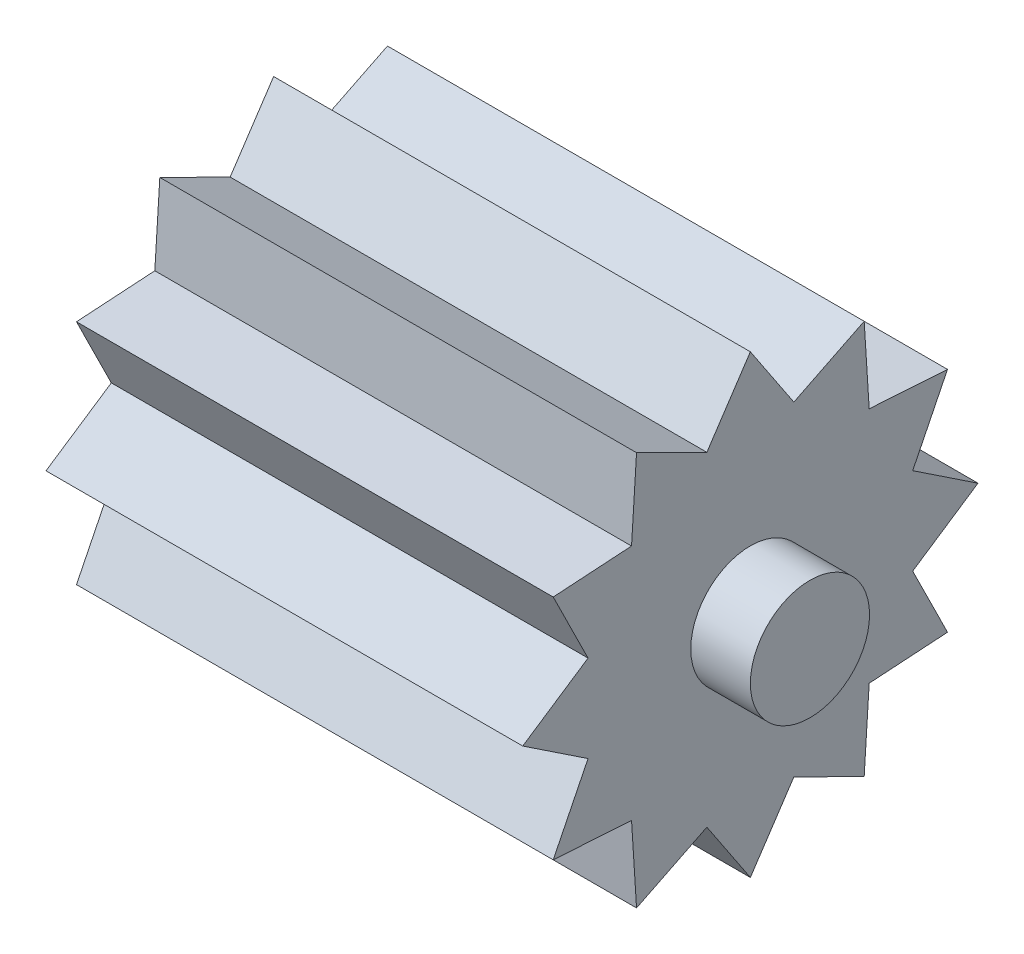
ISO-10303-21;
HEADER;
FILE_DESCRIPTION(('STEP AP214'),'2;1');
FILE_NAME('part.step','',(''),(''),'','','');
FILE_SCHEMA(('AUTOMOTIVE_DESIGN { 1 0 10303 214 1 1 1 1 }'));
ENDSEC;
DATA;
#1=APPLICATION_CONTEXT('core data for automotive mechanical design processes');
#2=APPLICATION_PROTOCOL_DEFINITION('international standard','automotive_design',2000,#1);
#3=PRODUCT_CONTEXT('',#1,'mechanical');
#4=PRODUCT('Part','Part','',(#3));
#5=PRODUCT_RELATED_PRODUCT_CATEGORY('part','',(#4));
#6=PRODUCT_DEFINITION_FORMATION('','',#4);
#7=PRODUCT_DEFINITION_CONTEXT('part definition',#1,'design');
#8=PRODUCT_DEFINITION('design','',#6,#7);
#9=PRODUCT_DEFINITION_SHAPE('','',#8);
#10=(LENGTH_UNIT() NAMED_UNIT(*) SI_UNIT(.MILLI.,.METRE.));
#11=(NAMED_UNIT(*) PLANE_ANGLE_UNIT() SI_UNIT($,.RADIAN.));
#12=(NAMED_UNIT(*) SI_UNIT($,.STERADIAN.) SOLID_ANGLE_UNIT());
#13=UNCERTAINTY_MEASURE_WITH_UNIT(LENGTH_MEASURE(1.E-05),#10,'distance_accuracy_value','');
#14=(GEOMETRIC_REPRESENTATION_CONTEXT(3) GLOBAL_UNCERTAINTY_ASSIGNED_CONTEXT((#13)) GLOBAL_UNIT_ASSIGNED_CONTEXT((#10,
#11,#12)) REPRESENTATION_CONTEXT('',''));
#15=CARTESIAN_POINT('',(0.,0.,0.));
#16=DIRECTION('',(0.,0.,1.));
#17=DIRECTION('',(1.,0.,0.));
#18=AXIS2_PLACEMENT_3D('',#15,#16,#17);
#19=CARTESIAN_POINT('',(-10.,8.27054260614139,-4.77500000000001));
#20=DIRECTION('',(0.,0.0638193116647596,-0.997961469926889));
#21=DIRECTION('',(0.,0.997961469926889,0.0638193116647596));
#22=AXIS2_PLACEMENT_3D('',#19,#20,#21);
#23=PLANE('',#22);
#24=DIRECTION('',(0.,0.997961469926889,0.0638193116647596));
#25=VECTOR('',#24,1.);
#26=CARTESIAN_POINT('',(0.,8.27054260614139,-4.77500000000001));
#27=LINE('',#26,#25);
#28=CARTESIAN_POINT('',(0.,4.98510280736515,-4.98510280736517));
#29=VERTEX_POINT('',#28);
#30=CARTESIAN_POINT('',(0.,8.27054260614139,-4.77500000000001));
#31=VERTEX_POINT('',#30);
#32=EDGE_CURVE('E203',#29,#31,#27,.T.);
#33=ORIENTED_EDGE('',*,*,#32,.F.);
#34=DIRECTION('',(1.,0.,0.));
#35=VECTOR('',#34,1.);
#36=CARTESIAN_POINT('',(-10.,4.98510280736515,-4.98510280736517));
#37=LINE('',#36,#35);
#38=CARTESIAN_POINT('',(-20.,4.98510280736515,-4.98510280736517));
#39=VERTEX_POINT('',#38);
#40=EDGE_CURVE('E47',#39,#29,#37,.T.);
#41=ORIENTED_EDGE('',*,*,#40,.F.);
#42=DIRECTION('',(0.,0.997961469926889,0.0638193116647596));
#43=VECTOR('',#42,1.);
#44=CARTESIAN_POINT('',(-20.,8.27054260614139,-4.77500000000001));
#45=LINE('',#44,#43);
#46=CARTESIAN_POINT('',(-20.,8.27054260614139,-4.77500000000001));
#47=VERTEX_POINT('',#46);
#48=EDGE_CURVE('E201',#39,#47,#45,.T.);
#49=ORIENTED_EDGE('',*,*,#48,.T.);
#50=DIRECTION('',(1.,0.,0.));
#51=VECTOR('',#50,1.);
#52=CARTESIAN_POINT('',(-10.,8.27054260614139,-4.77500000000001));
#53=LINE('',#52,#51);
#54=EDGE_CURVE('E357',#47,#31,#53,.T.);
#55=ORIENTED_EDGE('',*,*,#54,.T.);
#56=EDGE_LOOP('',(#33,#41,#49,#55));
#57=FACE_BOUND('',#56,.T.);
#58=ADVANCED_FACE('F40',(#57),#23,.T.);
#59=CARTESIAN_POINT('',(-10.,4.77499999999999,-8.2705426061414));
#60=DIRECTION('',(0.,0.997961469926889,-0.0638193116647596));
#61=DIRECTION('',(0.,0.0638193116647596,0.997961469926889));
#62=AXIS2_PLACEMENT_3D('',#59,#60,#61);
#63=PLANE('',#62);
#64=DIRECTION('',(0.,0.0638193116647596,0.997961469926889));
#65=VECTOR('',#64,1.);
#66=CARTESIAN_POINT('',(0.,4.77499999999999,-8.2705426061414));
#67=LINE('',#66,#65);
#68=CARTESIAN_POINT('',(0.,4.77499999999999,-8.2705426061414));
#69=VERTEX_POINT('',#68);
#70=EDGE_CURVE('E356',#69,#29,#67,.T.);
#71=ORIENTED_EDGE('',*,*,#70,.F.);
#72=DIRECTION('',(1.,0.,0.));
#73=VECTOR('',#72,1.);
#74=CARTESIAN_POINT('',(-10.,4.77499999999999,-8.2705426061414));
#75=LINE('',#74,#73);
#76=CARTESIAN_POINT('',(-20.,4.77499999999999,-8.2705426061414));
#77=VERTEX_POINT('',#76);
#78=EDGE_CURVE('E61',#77,#69,#75,.T.);
#79=ORIENTED_EDGE('',*,*,#78,.F.);
#80=DIRECTION('',(0.,0.0638193116647596,0.997961469926889));
#81=VECTOR('',#80,1.);
#82=CARTESIAN_POINT('',(-20.,4.77499999999999,-8.2705426061414));
#83=LINE('',#82,#81);
#84=EDGE_CURVE('E207',#77,#39,#83,.T.);
#85=ORIENTED_EDGE('',*,*,#84,.T.);
#86=ORIENTED_EDGE('',*,*,#40,.T.);
#87=EDGE_LOOP('',(#71,#79,#85,#86));
#88=FACE_BOUND('',#87,.T.);
#89=ADVANCED_FACE('F208',(#88),#63,.T.);
#90=CARTESIAN_POINT('',(-10.,4.77499999999999,-8.2705426061414));
#91=DIRECTION('',(0.,-0.443711589809727,-0.896169640787125));
#92=DIRECTION('',(0.,0.896169640787125,-0.443711589809727));
#93=AXIS2_PLACEMENT_3D('',#90,#91,#92);
#94=PLANE('',#93);
#95=DIRECTION('',(0.,0.896169640787125,-0.443711589809727));
#96=VECTOR('',#95,1.);
#97=CARTESIAN_POINT('',(0.,4.77499999999999,-8.2705426061414));
#98=LINE('',#97,#96);
#99=CARTESIAN_POINT('',(0.,1.82467426797276,-6.80977707533795));
#100=VERTEX_POINT('',#99);
#101=EDGE_CURVE('E354',#100,#69,#98,.T.);
#102=ORIENTED_EDGE('',*,*,#101,.F.);
#103=DIRECTION('',(1.,0.,0.));
#104=VECTOR('',#103,1.);
#105=CARTESIAN_POINT('',(-10.,1.82467426797276,-6.80977707533795));
#106=LINE('',#105,#104);
#107=CARTESIAN_POINT('',(-20.,1.82467426797276,-6.80977707533795));
#108=VERTEX_POINT('',#107);
#109=EDGE_CURVE('E360',#108,#100,#106,.T.);
#110=ORIENTED_EDGE('',*,*,#109,.F.);
#111=DIRECTION('',(0.,0.896169640787125,-0.443711589809727));
#112=VECTOR('',#111,1.);
#113=CARTESIAN_POINT('',(-20.,4.77499999999999,-8.2705426061414));
#114=LINE('',#113,#112);
#115=EDGE_CURVE('E211',#108,#77,#114,.T.);
#116=ORIENTED_EDGE('',*,*,#115,.T.);
#117=ORIENTED_EDGE('',*,*,#78,.T.);
#118=EDGE_LOOP('',(#102,#110,#116,#117));
#119=FACE_BOUND('',#118,.T.);
#120=ADVANCED_FACE('F408',(#119),#94,.T.);
#121=CARTESIAN_POINT('',(-10.,0.,-9.55000000000001));
#122=DIRECTION('',(0.,0.832350329122366,-0.554249880117162));
#123=DIRECTION('',(0.,0.554249880117162,0.832350329122366));
#124=AXIS2_PLACEMENT_3D('',#121,#122,#123);
#125=PLANE('',#124);
#126=DIRECTION('',(0.,0.554249880117162,0.832350329122366));
#127=VECTOR('',#126,1.);
#128=CARTESIAN_POINT('',(0.,0.,-9.55000000000001));
#129=LINE('',#128,#127);
#130=CARTESIAN_POINT('',(0.,0.,-9.55000000000001));
#131=VERTEX_POINT('',#130);
#132=EDGE_CURVE('E351',#131,#100,#129,.T.);
#133=ORIENTED_EDGE('',*,*,#132,.F.);
#134=DIRECTION('',(1.,0.,0.));
#135=VECTOR('',#134,1.);
#136=CARTESIAN_POINT('',(-10.,0.,-9.55000000000001));
#137=LINE('',#136,#135);
#138=CARTESIAN_POINT('',(-20.,0.,-9.55000000000001));
#139=VERTEX_POINT('',#138);
#140=EDGE_CURVE('E362',#139,#131,#137,.T.);
#141=ORIENTED_EDGE('',*,*,#140,.F.);
#142=DIRECTION('',(0.,0.554249880117162,0.832350329122366));
#143=VECTOR('',#142,1.);
#144=CARTESIAN_POINT('',(-20.,0.,-9.55000000000001));
#145=LINE('',#144,#143);
#146=EDGE_CURVE('E226',#139,#108,#145,.T.);
#147=ORIENTED_EDGE('',*,*,#146,.T.);
#148=ORIENTED_EDGE('',*,*,#109,.T.);
#149=EDGE_LOOP('',(#133,#141,#147,#148));
#150=FACE_BOUND('',#149,.T.);
#151=ADVANCED_FACE('F411',(#150),#125,.T.);
#152=CARTESIAN_POINT('',(-10.,0.,-9.55000000000001));
#153=DIRECTION('',(0.,-0.832350329122366,-0.554249880117162));
#154=DIRECTION('',(0.,0.554249880117163,-0.832350329122366));
#155=AXIS2_PLACEMENT_3D('',#152,#153,#154);
#156=PLANE('',#155);
#157=DIRECTION('',(0.,0.554249880117162,-0.832350329122366));
#158=VECTOR('',#157,1.);
#159=CARTESIAN_POINT('',(0.,0.,-9.55000000000001));
#160=LINE('',#159,#158);
#161=CARTESIAN_POINT('',(0.,-1.8246742679728,-6.80977707533795));
#162=VERTEX_POINT('',#161);
#163=EDGE_CURVE('E348',#162,#131,#160,.T.);
#164=ORIENTED_EDGE('',*,*,#163,.F.);
#165=DIRECTION('',(1.,0.,0.));
#166=VECTOR('',#165,1.);
#167=CARTESIAN_POINT('',(-10.,-1.8246742679728,-6.80977707533795));
#168=LINE('',#167,#166);
#169=CARTESIAN_POINT('',(-20.,-1.8246742679728,-6.80977707533795));
#170=VERTEX_POINT('',#169);
#171=EDGE_CURVE('E364',#170,#162,#168,.T.);
#172=ORIENTED_EDGE('',*,*,#171,.F.);
#173=DIRECTION('',(0.,0.554249880117162,-0.832350329122366));
#174=VECTOR('',#173,1.);
#175=CARTESIAN_POINT('',(-20.,0.,-9.55000000000001));
#176=LINE('',#175,#174);
#177=EDGE_CURVE('E229',#170,#139,#176,.T.);
#178=ORIENTED_EDGE('',*,*,#177,.T.);
#179=ORIENTED_EDGE('',*,*,#140,.T.);
#180=EDGE_LOOP('',(#164,#172,#178,#179));
#181=FACE_BOUND('',#180,.T.);
#182=ADVANCED_FACE('F417',(#181),#156,.T.);
#183=CARTESIAN_POINT('',(-10.,-4.77500000000003,-8.2705426061414));
#184=DIRECTION('',(0.,0.443711589809726,-0.896169640787125));
#185=DIRECTION('',(0.,0.896169640787125,0.443711589809726));
#186=AXIS2_PLACEMENT_3D('',#183,#184,#185);
#187=PLANE('',#186);
#188=DIRECTION('',(0.,0.896169640787125,0.443711589809727));
#189=VECTOR('',#188,1.);
#190=CARTESIAN_POINT('',(0.,-4.77500000000003,-8.2705426061414));
#191=LINE('',#190,#189);
#192=CARTESIAN_POINT('',(0.,-4.77500000000003,-8.2705426061414));
#193=VERTEX_POINT('',#192);
#194=EDGE_CURVE('E345',#193,#162,#191,.T.);
#195=ORIENTED_EDGE('',*,*,#194,.F.);
#196=DIRECTION('',(1.,0.,0.));
#197=VECTOR('',#196,1.);
#198=CARTESIAN_POINT('',(-10.,-4.77500000000003,-8.2705426061414));
#199=LINE('',#198,#197);
#200=CARTESIAN_POINT('',(-20.,-4.77500000000003,-8.2705426061414));
#201=VERTEX_POINT('',#200);
#202=EDGE_CURVE('E366',#201,#193,#199,.T.);
#203=ORIENTED_EDGE('',*,*,#202,.F.);
#204=DIRECTION('',(0.,0.896169640787125,0.443711589809727));
#205=VECTOR('',#204,1.);
#206=CARTESIAN_POINT('',(-20.,-4.77500000000003,-8.2705426061414));
#207=LINE('',#206,#205);
#208=EDGE_CURVE('E232',#201,#170,#207,.T.);
#209=ORIENTED_EDGE('',*,*,#208,.T.);
#210=ORIENTED_EDGE('',*,*,#171,.T.);
#211=EDGE_LOOP('',(#195,#203,#209,#210));
#212=FACE_BOUND('',#211,.T.);
#213=ADVANCED_FACE('F420',(#212),#187,.T.);
#214=CARTESIAN_POINT('',(-10.,-4.77500000000003,-8.2705426061414));
#215=DIRECTION('',(0.,-0.997961469926889,-0.0638193116647594));
#216=DIRECTION('',(0.,0.0638193116647594,-0.997961469926889));
#217=AXIS2_PLACEMENT_3D('',#214,#215,#216);
#218=PLANE('',#217);
#219=DIRECTION('',(0.,0.0638193116647594,-0.997961469926889));
#220=VECTOR('',#219,1.);
#221=CARTESIAN_POINT('',(0.,-4.77500000000003,-8.2705426061414));
#222=LINE('',#221,#220);
#223=CARTESIAN_POINT('',(0.,-4.98510280736519,-4.98510280736517));
#224=VERTEX_POINT('',#223);
#225=EDGE_CURVE('E342',#224,#193,#222,.T.);
#226=ORIENTED_EDGE('',*,*,#225,.F.);
#227=DIRECTION('',(1.,0.,0.));
#228=VECTOR('',#227,1.);
#229=CARTESIAN_POINT('',(-10.,-4.98510280736519,-4.98510280736517));
#230=LINE('',#229,#228);
#231=CARTESIAN_POINT('',(-20.,-4.98510280736519,-4.98510280736517));
#232=VERTEX_POINT('',#231);
#233=EDGE_CURVE('E368',#232,#224,#230,.T.);
#234=ORIENTED_EDGE('',*,*,#233,.F.);
#235=DIRECTION('',(0.,0.0638193116647594,-0.997961469926889));
#236=VECTOR('',#235,1.);
#237=CARTESIAN_POINT('',(-20.,-4.77500000000003,-8.2705426061414));
#238=LINE('',#237,#236);
#239=EDGE_CURVE('E235',#232,#201,#238,.T.);
#240=ORIENTED_EDGE('',*,*,#239,.T.);
#241=ORIENTED_EDGE('',*,*,#202,.T.);
#242=EDGE_LOOP('',(#226,#234,#240,#241));
#243=FACE_BOUND('',#242,.T.);
#244=ADVANCED_FACE('F423',(#243),#218,.T.);
#245=CARTESIAN_POINT('',(-10.,-8.27054260614142,-4.77500000000001));
#246=DIRECTION('',(0.,-0.0638193116647594,-0.997961469926889));
#247=DIRECTION('',(0.,0.997961469926889,-0.0638193116647594));
#248=AXIS2_PLACEMENT_3D('',#245,#246,#247);
#249=PLANE('',#248);
#250=DIRECTION('',(0.,0.997961469926889,-0.0638193116647594));
#251=VECTOR('',#250,1.);
#252=CARTESIAN_POINT('',(0.,-8.27054260614142,-4.77500000000001));
#253=LINE('',#252,#251);
#254=CARTESIAN_POINT('',(0.,-8.27054260614142,-4.77500000000001));
#255=VERTEX_POINT('',#254);
#256=EDGE_CURVE('E339',#255,#224,#253,.T.);
#257=ORIENTED_EDGE('',*,*,#256,.F.);
#258=DIRECTION('',(1.,0.,0.));
#259=VECTOR('',#258,1.);
#260=CARTESIAN_POINT('',(-10.,-8.27054260614142,-4.77500000000001));
#261=LINE('',#260,#259);
#262=CARTESIAN_POINT('',(-20.,-8.27054260614142,-4.77500000000001));
#263=VERTEX_POINT('',#262);
#264=EDGE_CURVE('E370',#263,#255,#261,.T.);
#265=ORIENTED_EDGE('',*,*,#264,.F.);
#266=DIRECTION('',(0.,0.997961469926889,-0.0638193116647594));
#267=VECTOR('',#266,1.);
#268=CARTESIAN_POINT('',(-20.,-8.27054260614142,-4.77500000000001));
#269=LINE('',#268,#267);
#270=EDGE_CURVE('E238',#263,#232,#269,.T.);
#271=ORIENTED_EDGE('',*,*,#270,.T.);
#272=ORIENTED_EDGE('',*,*,#233,.T.);
#273=EDGE_LOOP('',(#257,#265,#271,#272));
#274=FACE_BOUND('',#273,.T.);
#275=ADVANCED_FACE('F429',(#274),#249,.T.);
#276=CARTESIAN_POINT('',(-10.,-8.27054260614142,-4.77500000000001));
#277=DIRECTION('',(0.,-0.896169640787126,0.443711589809726));
#278=DIRECTION('',(0.,-0.443711589809726,-0.896169640787126));
#279=AXIS2_PLACEMENT_3D('',#276,#277,#278);
#280=PLANE('',#279);
#281=DIRECTION('',(0.,-0.443711589809726,-0.896169640787126));
#282=VECTOR('',#281,1.);
#283=CARTESIAN_POINT('',(0.,-8.27054260614142,-4.77500000000001));
#284=LINE('',#283,#282);
#285=CARTESIAN_POINT('',(0.,-6.80977707533797,-1.82467426797278));
#286=VERTEX_POINT('',#285);
#287=EDGE_CURVE('E336',#286,#255,#284,.T.);
#288=ORIENTED_EDGE('',*,*,#287,.F.);
#289=DIRECTION('',(1.,0.,0.));
#290=VECTOR('',#289,1.);
#291=CARTESIAN_POINT('',(-10.,-6.80977707533797,-1.82467426797278));
#292=LINE('',#291,#290);
#293=CARTESIAN_POINT('',(-20.,-6.80977707533797,-1.82467426797278));
#294=VERTEX_POINT('',#293);
#295=EDGE_CURVE('E372',#294,#286,#292,.T.);
#296=ORIENTED_EDGE('',*,*,#295,.F.);
#297=DIRECTION('',(0.,-0.443711589809726,-0.896169640787126));
#298=VECTOR('',#297,1.);
#299=CARTESIAN_POINT('',(-20.,-8.27054260614142,-4.77500000000001));
#300=LINE('',#299,#298);
#301=EDGE_CURVE('E241',#294,#263,#300,.T.);
#302=ORIENTED_EDGE('',*,*,#301,.T.);
#303=ORIENTED_EDGE('',*,*,#264,.T.);
#304=EDGE_LOOP('',(#288,#296,#302,#303));
#305=FACE_BOUND('',#304,.T.);
#306=ADVANCED_FACE('F432',(#305),#280,.T.);
#307=CARTESIAN_POINT('',(-10.,-9.55000000000004,0.));
#308=DIRECTION('',(0.,-0.554249880117163,-0.832350329122366));
#309=DIRECTION('',(0.,0.832350329122366,-0.554249880117163));
#310=AXIS2_PLACEMENT_3D('',#307,#308,#309);
#311=PLANE('',#310);
#312=DIRECTION('',(0.,0.832350329122366,-0.554249880117163));
#313=VECTOR('',#312,1.);
#314=CARTESIAN_POINT('',(0.,-9.55000000000004,0.));
#315=LINE('',#314,#313);
#316=CARTESIAN_POINT('',(0.,-9.55000000000004,0.));
#317=VERTEX_POINT('',#316);
#318=EDGE_CURVE('E333',#317,#286,#315,.T.);
#319=ORIENTED_EDGE('',*,*,#318,.F.);
#320=DIRECTION('',(1.,0.,0.));
#321=VECTOR('',#320,1.);
#322=CARTESIAN_POINT('',(-10.,-9.55000000000004,0.));
#323=LINE('',#322,#321);
#324=CARTESIAN_POINT('',(-20.,-9.55000000000004,0.));
#325=VERTEX_POINT('',#324);
#326=EDGE_CURVE('E374',#325,#317,#323,.T.);
#327=ORIENTED_EDGE('',*,*,#326,.F.);
#328=DIRECTION('',(0.,0.832350329122366,-0.554249880117163));
#329=VECTOR('',#328,1.);
#330=CARTESIAN_POINT('',(-20.,-9.55000000000004,0.));
#331=LINE('',#330,#329);
#332=EDGE_CURVE('E244',#325,#294,#331,.T.);
#333=ORIENTED_EDGE('',*,*,#332,.T.);
#334=ORIENTED_EDGE('',*,*,#295,.T.);
#335=EDGE_LOOP('',(#319,#327,#333,#334));
#336=FACE_BOUND('',#335,.T.);
#337=ADVANCED_FACE('F435',(#336),#311,.T.);
#338=CARTESIAN_POINT('',(-10.,-9.55000000000004,0.));
#339=DIRECTION('',(0.,-0.554249880117162,0.832350329122366));
#340=DIRECTION('',(0.,-0.832350329122366,-0.554249880117163));
#341=AXIS2_PLACEMENT_3D('',#338,#339,#340);
#342=PLANE('',#341);
#343=DIRECTION('',(0.,-0.832350329122366,-0.554249880117162));
#344=VECTOR('',#343,1.);
#345=CARTESIAN_POINT('',(0.,-9.55000000000004,0.));
#346=LINE('',#345,#344);
#347=CARTESIAN_POINT('',(0.,-6.80977707533797,1.82467426797278));
#348=VERTEX_POINT('',#347);
#349=EDGE_CURVE('E330',#348,#317,#346,.T.);
#350=ORIENTED_EDGE('',*,*,#349,.F.);
#351=DIRECTION('',(1.,0.,0.));
#352=VECTOR('',#351,1.);
#353=CARTESIAN_POINT('',(-10.,-6.80977707533797,1.82467426797278));
#354=LINE('',#353,#352);
#355=CARTESIAN_POINT('',(-20.,-6.80977707533797,1.82467426797278));
#356=VERTEX_POINT('',#355);
#357=EDGE_CURVE('E376',#356,#348,#354,.T.);
#358=ORIENTED_EDGE('',*,*,#357,.F.);
#359=DIRECTION('',(0.,-0.832350329122366,-0.554249880117162));
#360=VECTOR('',#359,1.);
#361=CARTESIAN_POINT('',(-20.,-9.55000000000004,0.));
#362=LINE('',#361,#360);
#363=EDGE_CURVE('E247',#356,#325,#362,.T.);
#364=ORIENTED_EDGE('',*,*,#363,.T.);
#365=ORIENTED_EDGE('',*,*,#326,.T.);
#366=EDGE_LOOP('',(#350,#358,#364,#365));
#367=FACE_BOUND('',#366,.T.);
#368=ADVANCED_FACE('F441',(#367),#342,.T.);
#369=CARTESIAN_POINT('',(-10.,-8.27054260614142,4.77500000000001));
#370=DIRECTION('',(0.,-0.896169640787125,-0.443711589809727));
#371=DIRECTION('',(0.,0.443711589809727,-0.896169640787125));
#372=AXIS2_PLACEMENT_3D('',#369,#370,#371);
#373=PLANE('',#372);
#374=DIRECTION('',(0.,0.443711589809727,-0.896169640787125));
#375=VECTOR('',#374,1.);
#376=CARTESIAN_POINT('',(0.,-8.27054260614142,4.77500000000001));
#377=LINE('',#376,#375);
#378=CARTESIAN_POINT('',(0.,-8.27054260614142,4.77500000000001));
#379=VERTEX_POINT('',#378);
#380=EDGE_CURVE('E327',#379,#348,#377,.T.);
#381=ORIENTED_EDGE('',*,*,#380,.F.);
#382=DIRECTION('',(1.,0.,0.));
#383=VECTOR('',#382,1.);
#384=CARTESIAN_POINT('',(-10.,-8.27054260614142,4.77500000000001));
#385=LINE('',#384,#383);
#386=CARTESIAN_POINT('',(-20.,-8.27054260614142,4.77500000000001));
#387=VERTEX_POINT('',#386);
#388=EDGE_CURVE('E378',#387,#379,#385,.T.);
#389=ORIENTED_EDGE('',*,*,#388,.F.);
#390=DIRECTION('',(0.,0.443711589809727,-0.896169640787125));
#391=VECTOR('',#390,1.);
#392=CARTESIAN_POINT('',(-20.,-8.27054260614142,4.77500000000001));
#393=LINE('',#392,#391);
#394=EDGE_CURVE('E250',#387,#356,#393,.T.);
#395=ORIENTED_EDGE('',*,*,#394,.T.);
#396=ORIENTED_EDGE('',*,*,#357,.T.);
#397=EDGE_LOOP('',(#381,#389,#395,#396));
#398=FACE_BOUND('',#397,.T.);
#399=ADVANCED_FACE('F444',(#398),#373,.T.);
#400=CARTESIAN_POINT('',(-10.,-8.27054260614142,4.77500000000001));
#401=DIRECTION('',(0.,-0.0638193116647596,0.997961469926889));
#402=DIRECTION('',(0.,-0.997961469926889,-0.0638193116647596));
#403=AXIS2_PLACEMENT_3D('',#400,#401,#402);
#404=PLANE('',#403);
#405=DIRECTION('',(0.,-0.997961469926889,-0.0638193116647596));
#406=VECTOR('',#405,1.);
#407=CARTESIAN_POINT('',(0.,-8.27054260614142,4.77500000000001));
#408=LINE('',#407,#406);
#409=CARTESIAN_POINT('',(0.,-4.98510280736519,4.98510280736518));
#410=VERTEX_POINT('',#409);
#411=EDGE_CURVE('E324',#410,#379,#408,.T.);
#412=ORIENTED_EDGE('',*,*,#411,.F.);
#413=DIRECTION('',(1.,0.,0.));
#414=VECTOR('',#413,1.);
#415=CARTESIAN_POINT('',(-10.,-4.98510280736519,4.98510280736518));
#416=LINE('',#415,#414);
#417=CARTESIAN_POINT('',(-20.,-4.98510280736519,4.98510280736518));
#418=VERTEX_POINT('',#417);
#419=EDGE_CURVE('E380',#418,#410,#416,.T.);
#420=ORIENTED_EDGE('',*,*,#419,.F.);
#421=DIRECTION('',(0.,-0.997961469926889,-0.0638193116647596));
#422=VECTOR('',#421,1.);
#423=CARTESIAN_POINT('',(-20.,-8.27054260614142,4.77500000000001));
#424=LINE('',#423,#422);
#425=EDGE_CURVE('E253',#418,#387,#424,.T.);
#426=ORIENTED_EDGE('',*,*,#425,.T.);
#427=ORIENTED_EDGE('',*,*,#388,.T.);
#428=EDGE_LOOP('',(#412,#420,#426,#427));
#429=FACE_BOUND('',#428,.T.);
#430=ADVANCED_FACE('F447',(#429),#404,.T.);
#431=CARTESIAN_POINT('',(-10.,-4.77500000000003,8.27054260614141));
#432=DIRECTION('',(0.,-0.997961469926889,0.0638193116647591));
#433=DIRECTION('',(0.,-0.0638193116647591,-0.997961469926889));
#434=AXIS2_PLACEMENT_3D('',#431,#432,#433);
#435=PLANE('',#434);
#436=DIRECTION('',(0.,-0.0638193116647591,-0.997961469926889));
#437=VECTOR('',#436,1.);
#438=CARTESIAN_POINT('',(0.,-4.77500000000003,8.27054260614141));
#439=LINE('',#438,#437);
#440=CARTESIAN_POINT('',(0.,-4.77500000000003,8.27054260614141));
#441=VERTEX_POINT('',#440);
#442=EDGE_CURVE('E321',#441,#410,#439,.T.);
#443=ORIENTED_EDGE('',*,*,#442,.F.);
#444=DIRECTION('',(1.,0.,0.));
#445=VECTOR('',#444,1.);
#446=CARTESIAN_POINT('',(-10.,-4.77500000000003,8.27054260614141));
#447=LINE('',#446,#445);
#448=CARTESIAN_POINT('',(-20.,-4.77500000000003,8.27054260614141));
#449=VERTEX_POINT('',#448);
#450=EDGE_CURVE('E382',#449,#441,#447,.T.);
#451=ORIENTED_EDGE('',*,*,#450,.F.);
#452=DIRECTION('',(0.,-0.0638193116647591,-0.997961469926889));
#453=VECTOR('',#452,1.);
#454=CARTESIAN_POINT('',(-20.,-4.77500000000003,8.27054260614141));
#455=LINE('',#454,#453);
#456=EDGE_CURVE('E256',#449,#418,#455,.T.);
#457=ORIENTED_EDGE('',*,*,#456,.T.);
#458=ORIENTED_EDGE('',*,*,#419,.T.);
#459=EDGE_LOOP('',(#443,#451,#457,#458));
#460=FACE_BOUND('',#459,.T.);
#461=ADVANCED_FACE('F453',(#460),#435,.T.);
#462=CARTESIAN_POINT('',(-10.,-4.77500000000003,8.27054260614141));
#463=DIRECTION('',(0.,0.443711589809726,0.896169640787125));
#464=DIRECTION('',(0.,-0.896169640787126,0.443711589809726));
#465=AXIS2_PLACEMENT_3D('',#462,#463,#464);
#466=PLANE('',#465);
#467=DIRECTION('',(0.,-0.896169640787125,0.443711589809726));
#468=VECTOR('',#467,1.);
#469=CARTESIAN_POINT('',(0.,-4.77500000000003,8.27054260614141));
#470=LINE('',#469,#468);
#471=CARTESIAN_POINT('',(0.,-1.8246742679728,6.80977707533795));
#472=VERTEX_POINT('',#471);
#473=EDGE_CURVE('E318',#472,#441,#470,.T.);
#474=ORIENTED_EDGE('',*,*,#473,.F.);
#475=DIRECTION('',(1.,0.,0.));
#476=VECTOR('',#475,1.);
#477=CARTESIAN_POINT('',(-10.,-1.8246742679728,6.80977707533795));
#478=LINE('',#477,#476);
#479=CARTESIAN_POINT('',(-20.,-1.8246742679728,6.80977707533795));
#480=VERTEX_POINT('',#479);
#481=EDGE_CURVE('E384',#480,#472,#478,.T.);
#482=ORIENTED_EDGE('',*,*,#481,.F.);
#483=DIRECTION('',(0.,-0.896169640787125,0.443711589809726));
#484=VECTOR('',#483,1.);
#485=CARTESIAN_POINT('',(-20.,-4.77500000000003,8.27054260614141));
#486=LINE('',#485,#484);
#487=EDGE_CURVE('E259',#480,#449,#486,.T.);
#488=ORIENTED_EDGE('',*,*,#487,.T.);
#489=ORIENTED_EDGE('',*,*,#450,.T.);
#490=EDGE_LOOP('',(#474,#482,#488,#489));
#491=FACE_BOUND('',#490,.T.);
#492=ADVANCED_FACE('F456',(#491),#466,.T.);
#493=CARTESIAN_POINT('',(-10.,0.,9.55000000000002));
#494=DIRECTION('',(0.,-0.832350329122366,0.554249880117163));
#495=DIRECTION('',(0.,-0.554249880117163,-0.832350329122366));
#496=AXIS2_PLACEMENT_3D('',#493,#494,#495);
#497=PLANE('',#496);
#498=DIRECTION('',(0.,-0.554249880117163,-0.832350329122366));
#499=VECTOR('',#498,1.);
#500=CARTESIAN_POINT('',(0.,0.,9.55000000000002));
#501=LINE('',#500,#499);
#502=CARTESIAN_POINT('',(0.,0.,9.55000000000002));
#503=VERTEX_POINT('',#502);
#504=EDGE_CURVE('E315',#503,#472,#501,.T.);
#505=ORIENTED_EDGE('',*,*,#504,.F.);
#506=DIRECTION('',(1.,0.,0.));
#507=VECTOR('',#506,1.);
#508=CARTESIAN_POINT('',(-10.,0.,9.55000000000002));
#509=LINE('',#508,#507);
#510=CARTESIAN_POINT('',(-20.,0.,9.55000000000002));
#511=VERTEX_POINT('',#510);
#512=EDGE_CURVE('E386',#511,#503,#509,.T.);
#513=ORIENTED_EDGE('',*,*,#512,.F.);
#514=DIRECTION('',(0.,-0.554249880117163,-0.832350329122366));
#515=VECTOR('',#514,1.);
#516=CARTESIAN_POINT('',(-20.,0.,9.55000000000002));
#517=LINE('',#516,#515);
#518=EDGE_CURVE('E262',#511,#480,#517,.T.);
#519=ORIENTED_EDGE('',*,*,#518,.T.);
#520=ORIENTED_EDGE('',*,*,#481,.T.);
#521=EDGE_LOOP('',(#505,#513,#519,#520));
#522=FACE_BOUND('',#521,.T.);
#523=ADVANCED_FACE('F459',(#522),#497,.T.);
#524=CARTESIAN_POINT('',(-10.,0.,9.55000000000002));
#525=DIRECTION('',(0.,0.832350329122366,0.554249880117162));
#526=DIRECTION('',(0.,-0.554249880117162,0.832350329122366));
#527=AXIS2_PLACEMENT_3D('',#524,#525,#526);
#528=PLANE('',#527);
#529=DIRECTION('',(0.,-0.554249880117162,0.832350329122366));
#530=VECTOR('',#529,1.);
#531=CARTESIAN_POINT('',(0.,0.,9.55000000000002));
#532=LINE('',#531,#530);
#533=CARTESIAN_POINT('',(0.,1.82467426797276,6.80977707533795));
#534=VERTEX_POINT('',#533);
#535=EDGE_CURVE('E312',#534,#503,#532,.T.);
#536=ORIENTED_EDGE('',*,*,#535,.F.);
#537=DIRECTION('',(1.,0.,0.));
#538=VECTOR('',#537,1.);
#539=CARTESIAN_POINT('',(-10.,1.82467426797276,6.80977707533795));
#540=LINE('',#539,#538);
#541=CARTESIAN_POINT('',(-20.,1.82467426797276,6.80977707533795));
#542=VERTEX_POINT('',#541);
#543=EDGE_CURVE('E388',#542,#534,#540,.T.);
#544=ORIENTED_EDGE('',*,*,#543,.F.);
#545=DIRECTION('',(0.,-0.554249880117162,0.832350329122366));
#546=VECTOR('',#545,1.);
#547=CARTESIAN_POINT('',(-20.,0.,9.55000000000002));
#548=LINE('',#547,#546);
#549=EDGE_CURVE('E265',#542,#511,#548,.T.);
#550=ORIENTED_EDGE('',*,*,#549,.T.);
#551=ORIENTED_EDGE('',*,*,#512,.T.);
#552=EDGE_LOOP('',(#536,#544,#550,#551));
#553=FACE_BOUND('',#552,.T.);
#554=ADVANCED_FACE('F465',(#553),#528,.T.);
#555=CARTESIAN_POINT('',(-10.,4.77499999999999,8.27054260614141));
#556=DIRECTION('',(0.,-0.443711589809728,0.896169640787125));
#557=DIRECTION('',(0.,-0.896169640787125,-0.443711589809728));
#558=AXIS2_PLACEMENT_3D('',#555,#556,#557);
#559=PLANE('',#558);
#560=DIRECTION('',(0.,-0.896169640787125,-0.443711589809728));
#561=VECTOR('',#560,1.);
#562=CARTESIAN_POINT('',(0.,4.77499999999999,8.27054260614141));
#563=LINE('',#562,#561);
#564=CARTESIAN_POINT('',(0.,4.77499999999999,8.27054260614141));
#565=VERTEX_POINT('',#564);
#566=EDGE_CURVE('E309',#565,#534,#563,.T.);
#567=ORIENTED_EDGE('',*,*,#566,.F.);
#568=DIRECTION('',(1.,0.,0.));
#569=VECTOR('',#568,1.);
#570=CARTESIAN_POINT('',(-10.,4.77499999999999,8.27054260614141));
#571=LINE('',#570,#569);
#572=CARTESIAN_POINT('',(-20.,4.77499999999999,8.27054260614141));
#573=VERTEX_POINT('',#572);
#574=EDGE_CURVE('E390',#573,#565,#571,.T.);
#575=ORIENTED_EDGE('',*,*,#574,.F.);
#576=DIRECTION('',(0.,-0.896169640787125,-0.443711589809728));
#577=VECTOR('',#576,1.);
#578=CARTESIAN_POINT('',(-20.,4.77499999999999,8.27054260614141));
#579=LINE('',#578,#577);
#580=EDGE_CURVE('E268',#573,#542,#579,.T.);
#581=ORIENTED_EDGE('',*,*,#580,.T.);
#582=ORIENTED_EDGE('',*,*,#543,.T.);
#583=EDGE_LOOP('',(#567,#575,#581,#582));
#584=FACE_BOUND('',#583,.T.);
#585=ADVANCED_FACE('F468',(#584),#559,.T.);
#586=CARTESIAN_POINT('',(-10.,4.77499999999999,8.27054260614141));
#587=DIRECTION('',(0.,0.997961469926889,0.0638193116647602));
#588=DIRECTION('',(0.,-0.0638193116647602,0.997961469926889));
#589=AXIS2_PLACEMENT_3D('',#586,#587,#588);
#590=PLANE('',#589);
#591=DIRECTION('',(0.,-0.0638193116647602,0.997961469926889));
#592=VECTOR('',#591,1.);
#593=CARTESIAN_POINT('',(0.,4.77499999999999,8.27054260614141));
#594=LINE('',#593,#592);
#595=CARTESIAN_POINT('',(0.,4.98510280736515,4.98510280736518));
#596=VERTEX_POINT('',#595);
#597=EDGE_CURVE('E306',#596,#565,#594,.T.);
#598=ORIENTED_EDGE('',*,*,#597,.F.);
#599=DIRECTION('',(1.,0.,0.));
#600=VECTOR('',#599,1.);
#601=CARTESIAN_POINT('',(-10.,4.98510280736515,4.98510280736518));
#602=LINE('',#601,#600);
#603=CARTESIAN_POINT('',(-20.,4.98510280736515,4.98510280736518));
#604=VERTEX_POINT('',#603);
#605=EDGE_CURVE('E392',#604,#596,#602,.T.);
#606=ORIENTED_EDGE('',*,*,#605,.F.);
#607=DIRECTION('',(0.,-0.0638193116647602,0.997961469926889));
#608=VECTOR('',#607,1.);
#609=CARTESIAN_POINT('',(-20.,4.77499999999999,8.27054260614141));
#610=LINE('',#609,#608);
#611=EDGE_CURVE('E271',#604,#573,#610,.T.);
#612=ORIENTED_EDGE('',*,*,#611,.T.);
#613=ORIENTED_EDGE('',*,*,#574,.T.);
#614=EDGE_LOOP('',(#598,#606,#612,#613));
#615=FACE_BOUND('',#614,.T.);
#616=ADVANCED_FACE('F471',(#615),#590,.T.);
#617=CARTESIAN_POINT('',(-10.,8.27054260614138,4.77500000000001));
#618=DIRECTION('',(0.,0.0638193116647596,0.997961469926889));
#619=DIRECTION('',(0.,-0.997961469926889,0.0638193116647596));
#620=AXIS2_PLACEMENT_3D('',#617,#618,#619);
#621=PLANE('',#620);
#622=DIRECTION('',(0.,-0.997961469926889,0.0638193116647596));
#623=VECTOR('',#622,1.);
#624=CARTESIAN_POINT('',(0.,8.27054260614138,4.77500000000001));
#625=LINE('',#624,#623);
#626=CARTESIAN_POINT('',(0.,8.27054260614138,4.77500000000001));
#627=VERTEX_POINT('',#626);
#628=EDGE_CURVE('E303',#627,#596,#625,.T.);
#629=ORIENTED_EDGE('',*,*,#628,.F.);
#630=DIRECTION('',(1.,0.,0.));
#631=VECTOR('',#630,1.);
#632=CARTESIAN_POINT('',(-10.,8.27054260614138,4.77500000000001));
#633=LINE('',#632,#631);
#634=CARTESIAN_POINT('',(-20.,8.27054260614138,4.77500000000001));
#635=VERTEX_POINT('',#634);
#636=EDGE_CURVE('E394',#635,#627,#633,.T.);
#637=ORIENTED_EDGE('',*,*,#636,.F.);
#638=DIRECTION('',(0.,-0.997961469926889,0.0638193116647596));
#639=VECTOR('',#638,1.);
#640=CARTESIAN_POINT('',(-20.,8.27054260614138,4.77500000000001));
#641=LINE('',#640,#639);
#642=EDGE_CURVE('E274',#635,#604,#641,.T.);
#643=ORIENTED_EDGE('',*,*,#642,.T.);
#644=ORIENTED_EDGE('',*,*,#605,.T.);
#645=EDGE_LOOP('',(#629,#637,#643,#644));
#646=FACE_BOUND('',#645,.T.);
#647=ADVANCED_FACE('F477',(#646),#621,.T.);
#648=CARTESIAN_POINT('',(-10.,8.27054260614138,4.77500000000001));
#649=DIRECTION('',(0.,0.896169640787126,-0.443711589809726));
#650=DIRECTION('',(0.,0.443711589809726,0.896169640787126));
#651=AXIS2_PLACEMENT_3D('',#648,#649,#650);
#652=PLANE('',#651);
#653=DIRECTION('',(0.,0.443711589809726,0.896169640787126));
#654=VECTOR('',#653,1.);
#655=CARTESIAN_POINT('',(0.,8.27054260614138,4.77500000000001));
#656=LINE('',#655,#654);
#657=CARTESIAN_POINT('',(0.,6.80977707533793,1.82467426797278));
#658=VERTEX_POINT('',#657);
#659=EDGE_CURVE('E300',#658,#627,#656,.T.);
#660=ORIENTED_EDGE('',*,*,#659,.F.);
#661=DIRECTION('',(1.,0.,0.));
#662=VECTOR('',#661,1.);
#663=CARTESIAN_POINT('',(-10.,6.80977707533793,1.82467426797278));
#664=LINE('',#663,#662);
#665=CARTESIAN_POINT('',(-20.,6.80977707533793,1.82467426797278));
#666=VERTEX_POINT('',#665);
#667=EDGE_CURVE('E396',#666,#658,#664,.T.);
#668=ORIENTED_EDGE('',*,*,#667,.F.);
#669=DIRECTION('',(0.,0.443711589809726,0.896169640787126));
#670=VECTOR('',#669,1.);
#671=CARTESIAN_POINT('',(-20.,8.27054260614138,4.77500000000001));
#672=LINE('',#671,#670);
#673=EDGE_CURVE('E277',#666,#635,#672,.T.);
#674=ORIENTED_EDGE('',*,*,#673,.T.);
#675=ORIENTED_EDGE('',*,*,#636,.T.);
#676=EDGE_LOOP('',(#660,#668,#674,#675));
#677=FACE_BOUND('',#676,.T.);
#678=ADVANCED_FACE('F480',(#677),#652,.T.);
#679=CARTESIAN_POINT('',(-10.,9.55,0.));
#680=DIRECTION('',(0.,0.554249880117162,0.832350329122366));
#681=DIRECTION('',(0.,-0.832350329122366,0.554249880117162));
#682=AXIS2_PLACEMENT_3D('',#679,#680,#681);
#683=PLANE('',#682);
#684=DIRECTION('',(0.,-0.832350329122366,0.554249880117162));
#685=VECTOR('',#684,1.);
#686=CARTESIAN_POINT('',(0.,9.55,0.));
#687=LINE('',#686,#685);
#688=CARTESIAN_POINT('',(0.,9.55,0.));
#689=VERTEX_POINT('',#688);
#690=EDGE_CURVE('E297',#689,#658,#687,.T.);
#691=ORIENTED_EDGE('',*,*,#690,.F.);
#692=DIRECTION('',(1.,0.,0.));
#693=VECTOR('',#692,1.);
#694=CARTESIAN_POINT('',(-10.,9.55,0.));
#695=LINE('',#694,#693);
#696=CARTESIAN_POINT('',(-20.,9.55,0.));
#697=VERTEX_POINT('',#696);
#698=EDGE_CURVE('E398',#697,#689,#695,.T.);
#699=ORIENTED_EDGE('',*,*,#698,.F.);
#700=DIRECTION('',(0.,-0.832350329122366,0.554249880117162));
#701=VECTOR('',#700,1.);
#702=CARTESIAN_POINT('',(-20.,9.55,0.));
#703=LINE('',#702,#701);
#704=EDGE_CURVE('E280',#697,#666,#703,.T.);
#705=ORIENTED_EDGE('',*,*,#704,.T.);
#706=ORIENTED_EDGE('',*,*,#667,.T.);
#707=EDGE_LOOP('',(#691,#699,#705,#706));
#708=FACE_BOUND('',#707,.T.);
#709=ADVANCED_FACE('F483',(#708),#683,.T.);
#710=CARTESIAN_POINT('',(-10.,9.55,0.));
#711=DIRECTION('',(0.,0.554249880117162,-0.832350329122366));
#712=DIRECTION('',(0.,0.832350329122366,0.554249880117162));
#713=AXIS2_PLACEMENT_3D('',#710,#711,#712);
#714=PLANE('',#713);
#715=DIRECTION('',(0.,0.832350329122366,0.554249880117162));
#716=VECTOR('',#715,1.);
#717=CARTESIAN_POINT('',(0.,9.55,0.));
#718=LINE('',#717,#716);
#719=CARTESIAN_POINT('',(0.,6.80977707533793,-1.82467426797278));
#720=VERTEX_POINT('',#719);
#721=EDGE_CURVE('E294',#720,#689,#718,.T.);
#722=ORIENTED_EDGE('',*,*,#721,.F.);
#723=DIRECTION('',(1.,0.,0.));
#724=VECTOR('',#723,1.);
#725=CARTESIAN_POINT('',(-10.,6.80977707533793,-1.82467426797278));
#726=LINE('',#725,#724);
#727=CARTESIAN_POINT('',(-20.,6.80977707533793,-1.82467426797278));
#728=VERTEX_POINT('',#727);
#729=EDGE_CURVE('E400',#728,#720,#726,.T.);
#730=ORIENTED_EDGE('',*,*,#729,.F.);
#731=DIRECTION('',(0.,0.832350329122366,0.554249880117162));
#732=VECTOR('',#731,1.);
#733=CARTESIAN_POINT('',(-20.,9.55,0.));
#734=LINE('',#733,#732);
#735=EDGE_CURVE('E283',#728,#697,#734,.T.);
#736=ORIENTED_EDGE('',*,*,#735,.T.);
#737=ORIENTED_EDGE('',*,*,#698,.T.);
#738=EDGE_LOOP('',(#722,#730,#736,#737));
#739=FACE_BOUND('',#738,.T.);
#740=ADVANCED_FACE('F485',(#739),#714,.T.);
#741=CARTESIAN_POINT('',(-10.,8.27054260614139,-4.77500000000001));
#742=DIRECTION('',(0.,0.896169640787125,0.443711589809727));
#743=DIRECTION('',(0.,-0.443711589809727,0.896169640787125));
#744=AXIS2_PLACEMENT_3D('',#741,#742,#743);
#745=PLANE('',#744);
#746=DIRECTION('',(0.,-0.443711589809727,0.896169640787125));
#747=VECTOR('',#746,1.);
#748=CARTESIAN_POINT('',(0.,8.27054260614139,-4.77500000000001));
#749=LINE('',#748,#747);
#750=EDGE_CURVE('E291',#31,#720,#749,.T.);
#751=ORIENTED_EDGE('',*,*,#750,.F.);
#752=ORIENTED_EDGE('',*,*,#54,.F.);
#753=DIRECTION('',(0.,-0.443711589809727,0.896169640787125));
#754=VECTOR('',#753,1.);
#755=CARTESIAN_POINT('',(-20.,8.27054260614139,-4.77500000000001));
#756=LINE('',#755,#754);
#757=EDGE_CURVE('E217',#47,#728,#756,.T.);
#758=ORIENTED_EDGE('',*,*,#757,.T.);
#759=ORIENTED_EDGE('',*,*,#729,.T.);
#760=EDGE_LOOP('',(#751,#752,#758,#759));
#761=FACE_BOUND('',#760,.T.);
#762=ADVANCED_FACE('F403',(#761),#745,.T.);
#763=CARTESIAN_POINT('',(0.,0.,0.));
#764=DIRECTION('',(-1.,0.,0.));
#765=DIRECTION('',(0.,0.,1.));
#766=AXIS2_PLACEMENT_3D('',#763,#764,#765);
#767=PLANE('',#766);
#768=CARTESIAN_POINT('',(0.,0.,0.));
#769=DIRECTION('',(-1.,0.,0.));
#770=DIRECTION('',(0.,0.,1.));
#771=AXIS2_PLACEMENT_3D('',#768,#769,#770);
#772=CIRCLE('',#771,2.5);
#773=CARTESIAN_POINT('',(0.,0.,2.5));
#774=VERTEX_POINT('',#773);
#775=EDGE_CURVE('E11',#774,#774,#772,.F.);
#776=ORIENTED_EDGE('',*,*,#775,.F.);
#777=EDGE_LOOP('',(#776));
#778=FACE_BOUND('',#777,.T.);
#779=ORIENTED_EDGE('',*,*,#32,.T.);
#780=ORIENTED_EDGE('',*,*,#750,.T.);
#781=ORIENTED_EDGE('',*,*,#721,.T.);
#782=ORIENTED_EDGE('',*,*,#690,.T.);
#783=ORIENTED_EDGE('',*,*,#659,.T.);
#784=ORIENTED_EDGE('',*,*,#628,.T.);
#785=ORIENTED_EDGE('',*,*,#597,.T.);
#786=ORIENTED_EDGE('',*,*,#566,.T.);
#787=ORIENTED_EDGE('',*,*,#535,.T.);
#788=ORIENTED_EDGE('',*,*,#504,.T.);
#789=ORIENTED_EDGE('',*,*,#473,.T.);
#790=ORIENTED_EDGE('',*,*,#442,.T.);
#791=ORIENTED_EDGE('',*,*,#411,.T.);
#792=ORIENTED_EDGE('',*,*,#380,.T.);
#793=ORIENTED_EDGE('',*,*,#349,.T.);
#794=ORIENTED_EDGE('',*,*,#318,.T.);
#795=ORIENTED_EDGE('',*,*,#287,.T.);
#796=ORIENTED_EDGE('',*,*,#256,.T.);
#797=ORIENTED_EDGE('',*,*,#225,.T.);
#798=ORIENTED_EDGE('',*,*,#194,.T.);
#799=ORIENTED_EDGE('',*,*,#163,.T.);
#800=ORIENTED_EDGE('',*,*,#132,.T.);
#801=ORIENTED_EDGE('',*,*,#101,.T.);
#802=ORIENTED_EDGE('',*,*,#70,.T.);
#803=EDGE_LOOP('',(#779,#780,#781,#782,#783,#784,#785,#786,#787,#788,#789,#790,#791,#792,#793,
#794,#795,#796,#797,#798,#799,#800,#801,#802));
#804=FACE_BOUND('',#803,.T.);
#805=ADVANCED_FACE('F406',(#778,#804),#767,.F.);
#806=CARTESIAN_POINT('',(2.5,0.,0.));
#807=DIRECTION('',(-1.,0.,0.));
#808=DIRECTION('',(0.,0.,1.));
#809=AXIS2_PLACEMENT_3D('',#806,#807,#808);
#810=CYLINDRICAL_SURFACE('',#809,2.5);
#811=CARTESIAN_POINT('',(2.5,0.,0.));
#812=DIRECTION('',(1.,0.,0.));
#813=DIRECTION('',(0.,0.,-1.));
#814=AXIS2_PLACEMENT_3D('',#811,#812,#813);
#815=CIRCLE('',#814,2.5);
#816=CARTESIAN_POINT('',(2.5,0.,-2.5));
#817=VERTEX_POINT('',#816);
#818=EDGE_CURVE('E287',#817,#817,#815,.T.);
#819=ORIENTED_EDGE('',*,*,#818,.F.);
#820=EDGE_LOOP('',(#819));
#821=FACE_BOUND('',#820,.T.);
#822=ORIENTED_EDGE('',*,*,#775,.T.);
#823=EDGE_LOOP('',(#822));
#824=FACE_BOUND('',#823,.T.);
#825=ADVANCED_FACE('F607',(#821,#824),#810,.T.);
#826=CARTESIAN_POINT('',(2.5,0.,0.));
#827=DIRECTION('',(1.,0.,0.));
#828=DIRECTION('',(0.,0.,-1.));
#829=AXIS2_PLACEMENT_3D('',#826,#827,#828);
#830=PLANE('',#829);
#831=ORIENTED_EDGE('',*,*,#818,.T.);
#832=EDGE_LOOP('',(#831));
#833=FACE_BOUND('',#832,.T.);
#834=ADVANCED_FACE('F572',(#833),#830,.T.);
#835=CARTESIAN_POINT('',(-20.,0.,0.));
#836=DIRECTION('',(1.,0.,0.));
#837=DIRECTION('',(0.,0.,1.));
#838=AXIS2_PLACEMENT_3D('',#835,#836,#837);
#839=PLANE('',#838);
#840=CARTESIAN_POINT('',(-20.,0.,0.));
#841=DIRECTION('',(1.,0.,0.));
#842=DIRECTION('',(0.,0.,-1.));
#843=AXIS2_PLACEMENT_3D('',#840,#841,#842);
#844=CIRCLE('',#843,2.5);
#845=CARTESIAN_POINT('',(-20.,0.,-2.5));
#846=VERTEX_POINT('',#845);
#847=EDGE_CURVE('E221',#846,#846,#844,.T.);
#848=ORIENTED_EDGE('',*,*,#847,.T.);
#849=EDGE_LOOP('',(#848));
#850=FACE_BOUND('',#849,.T.);
#851=ORIENTED_EDGE('',*,*,#48,.F.);
#852=ORIENTED_EDGE('',*,*,#84,.F.);
#853=ORIENTED_EDGE('',*,*,#115,.F.);
#854=ORIENTED_EDGE('',*,*,#146,.F.);
#855=ORIENTED_EDGE('',*,*,#177,.F.);
#856=ORIENTED_EDGE('',*,*,#208,.F.);
#857=ORIENTED_EDGE('',*,*,#239,.F.);
#858=ORIENTED_EDGE('',*,*,#270,.F.);
#859=ORIENTED_EDGE('',*,*,#301,.F.);
#860=ORIENTED_EDGE('',*,*,#332,.F.);
#861=ORIENTED_EDGE('',*,*,#363,.F.);
#862=ORIENTED_EDGE('',*,*,#394,.F.);
#863=ORIENTED_EDGE('',*,*,#425,.F.);
#864=ORIENTED_EDGE('',*,*,#456,.F.);
#865=ORIENTED_EDGE('',*,*,#487,.F.);
#866=ORIENTED_EDGE('',*,*,#518,.F.);
#867=ORIENTED_EDGE('',*,*,#549,.F.);
#868=ORIENTED_EDGE('',*,*,#580,.F.);
#869=ORIENTED_EDGE('',*,*,#611,.F.);
#870=ORIENTED_EDGE('',*,*,#642,.F.);
#871=ORIENTED_EDGE('',*,*,#673,.F.);
#872=ORIENTED_EDGE('',*,*,#704,.F.);
#873=ORIENTED_EDGE('',*,*,#735,.F.);
#874=ORIENTED_EDGE('',*,*,#757,.F.);
#875=EDGE_LOOP('',(#851,#852,#853,#854,#855,#856,#857,#858,#859,#860,#861,#862,#863,#864,#865,
#866,#867,#868,#869,#870,#871,#872,#873,#874));
#876=FACE_BOUND('',#875,.T.);
#877=ADVANCED_FACE('F214',(#850,#876),#839,.F.);
#878=CARTESIAN_POINT('',(-22.5,0.,0.));
#879=DIRECTION('',(1.,0.,0.));
#880=DIRECTION('',(0.,0.,-1.));
#881=AXIS2_PLACEMENT_3D('',#878,#879,#880);
#882=CYLINDRICAL_SURFACE('',#881,2.5);
#883=CARTESIAN_POINT('',(-22.5,0.,0.));
#884=DIRECTION('',(1.,0.,0.));
#885=DIRECTION('',(0.,0.,-1.));
#886=AXIS2_PLACEMENT_3D('',#883,#884,#885);
#887=CIRCLE('',#886,2.5);
#888=CARTESIAN_POINT('',(-22.5,0.,-2.5));
#889=VERTEX_POINT('',#888);
#890=EDGE_CURVE('E218',#889,#889,#887,.T.);
#891=ORIENTED_EDGE('',*,*,#890,.T.);
#892=EDGE_LOOP('',(#891));
#893=FACE_BOUND('',#892,.T.);
#894=ORIENTED_EDGE('',*,*,#847,.F.);
#895=EDGE_LOOP('',(#894));
#896=FACE_BOUND('',#895,.T.);
#897=ADVANCED_FACE('F571',(#893,#896),#882,.T.);
#898=CARTESIAN_POINT('',(-22.5,0.,0.));
#899=DIRECTION('',(-1.,0.,0.));
#900=DIRECTION('',(0.,0.,-1.));
#901=AXIS2_PLACEMENT_3D('',#898,#899,#900);
#902=PLANE('',#901);
#903=ORIENTED_EDGE('',*,*,#890,.F.);
#904=EDGE_LOOP('',(#903));
#905=FACE_BOUND('',#904,.T.);
#906=ADVANCED_FACE('F584',(#905),#902,.T.);
#907=CLOSED_SHELL('',(#58,#89,#120,#151,#182,#213,#244,#275,#306,#337,#368,#399,#430,#461,#492,
#523,#554,#585,#616,#647,#678,#709,#740,#762,#805,#825,#834,#877,#897,#906));
#908=MANIFOLD_SOLID_BREP('B2',#907);
#909=ADVANCED_BREP_SHAPE_REPRESENTATION('',(#18,#908),#14);
#910=SHAPE_DEFINITION_REPRESENTATION(#9,#909);
ENDSEC;
END-ISO-10303-21;
